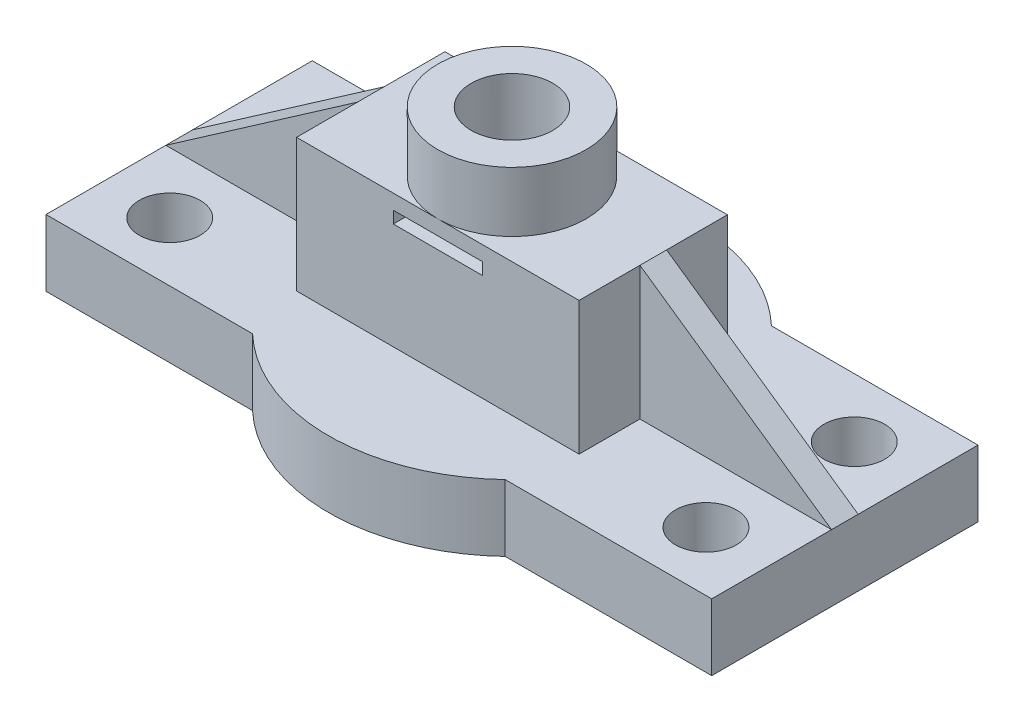
ISO-10303-21;
HEADER;
FILE_DESCRIPTION(('STEP AP214'),'2;1');
FILE_NAME('part.step','',(''),(''),'','','');
FILE_SCHEMA(('AUTOMOTIVE_DESIGN { 1 0 10303 214 1 1 1 1 }'));
ENDSEC;
DATA;
#1=APPLICATION_CONTEXT('core data for automotive mechanical design processes');
#2=APPLICATION_PROTOCOL_DEFINITION('international standard','automotive_design',2000,#1);
#3=PRODUCT_CONTEXT('',#1,'mechanical');
#4=PRODUCT('Part','Part','',(#3));
#5=PRODUCT_RELATED_PRODUCT_CATEGORY('part','',(#4));
#6=PRODUCT_DEFINITION_FORMATION('','',#4);
#7=PRODUCT_DEFINITION_CONTEXT('part definition',#1,'design');
#8=PRODUCT_DEFINITION('design','',#6,#7);
#9=PRODUCT_DEFINITION_SHAPE('','',#8);
#10=(LENGTH_UNIT() NAMED_UNIT(*) SI_UNIT(.MILLI.,.METRE.));
#11=(NAMED_UNIT(*) PLANE_ANGLE_UNIT() SI_UNIT($,.RADIAN.));
#12=(NAMED_UNIT(*) SI_UNIT($,.STERADIAN.) SOLID_ANGLE_UNIT());
#13=UNCERTAINTY_MEASURE_WITH_UNIT(LENGTH_MEASURE(1.E-05),#10,'distance_accuracy_value','');
#14=(GEOMETRIC_REPRESENTATION_CONTEXT(3) GLOBAL_UNCERTAINTY_ASSIGNED_CONTEXT((#13)) GLOBAL_UNIT_ASSIGNED_CONTEXT((#10,
#11,#12)) REPRESENTATION_CONTEXT('',''));
#15=CARTESIAN_POINT('',(0.,0.,0.));
#16=DIRECTION('',(0.,0.,1.));
#17=DIRECTION('',(1.,0.,0.));
#18=AXIS2_PLACEMENT_3D('',#15,#16,#17);
#19=CARTESIAN_POINT('',(0.,30.,0.));
#20=DIRECTION('',(0.,1.,0.));
#21=DIRECTION('',(0.,0.,1.));
#22=AXIS2_PLACEMENT_3D('',#19,#20,#21);
#23=PLANE('',#22);
#24=CARTESIAN_POINT('',(0.,30.,0.));
#25=DIRECTION('',(0.,1.,0.));
#26=DIRECTION('',(0.,0.,1.));
#27=AXIS2_PLACEMENT_3D('',#24,#25,#26);
#28=CIRCLE('',#27,11.1391021800904);
#29=CARTESIAN_POINT('',(0.,30.,11.1391021800904));
#30=VERTEX_POINT('',#29);
#31=CARTESIAN_POINT('',(0.,30.,-11.1391021800904));
#32=VERTEX_POINT('',#31);
#33=EDGE_CURVE('E258',#30,#32,#28,.T.);
#34=ORIENTED_EDGE('',*,*,#33,.F.);
#35=DIRECTION('',(1.,0.,0.));
#36=VECTOR('',#35,1.);
#37=CARTESIAN_POINT('',(-21.2181319609984,30.,11.1391021800904));
#38=LINE('',#37,#36);
#39=CARTESIAN_POINT('',(21.2181319609984,30.,11.1391021800904));
#40=VERTEX_POINT('',#39);
#41=EDGE_CURVE('E316',#30,#40,#38,.T.);
#42=ORIENTED_EDGE('',*,*,#41,.T.);
#43=DIRECTION('',(0.,0.,-1.));
#44=VECTOR('',#43,1.);
#45=CARTESIAN_POINT('',(21.2181319609984,30.,-11.1391021800904));
#46=LINE('',#45,#44);
#47=CARTESIAN_POINT('',(21.2181319609984,30.,2.));
#48=VERTEX_POINT('',#47);
#49=EDGE_CURVE('E304',#40,#48,#46,.T.);
#50=ORIENTED_EDGE('',*,*,#49,.T.);
#51=DIRECTION('',(0.,0.,-1.));
#52=VECTOR('',#51,1.);
#53=CARTESIAN_POINT('',(21.2181319609984,30.,2.));
#54=LINE('',#53,#52);
#55=CARTESIAN_POINT('',(21.2181319609984,30.,-2.));
#56=VERTEX_POINT('',#55);
#57=EDGE_CURVE('E273',#48,#56,#54,.T.);
#58=ORIENTED_EDGE('',*,*,#57,.T.);
#59=CARTESIAN_POINT('',(21.2181319609984,30.,-11.1391021800904));
#60=VERTEX_POINT('',#59);
#61=EDGE_CURVE('E308',#56,#60,#46,.T.);
#62=ORIENTED_EDGE('',*,*,#61,.T.);
#63=DIRECTION('',(-1.,0.,0.));
#64=VECTOR('',#63,1.);
#65=CARTESIAN_POINT('',(-21.2181319609984,30.,-11.1391021800904));
#66=LINE('',#65,#64);
#67=EDGE_CURVE('E309',#60,#32,#66,.T.);
#68=ORIENTED_EDGE('',*,*,#67,.T.);
#69=EDGE_LOOP('',(#34,#42,#50,#58,#62,#68));
#70=FACE_BOUND('',#69,.T.);
#71=ADVANCED_FACE('F43',(#70),#23,.T.);
#72=CARTESIAN_POINT('',(0.,10.,0.));
#73=DIRECTION('',(0.,1.,0.));
#74=DIRECTION('',(0.,0.,1.));
#75=AXIS2_PLACEMENT_3D('',#72,#73,#74);
#76=PLANE('',#75);
#77=CARTESIAN_POINT('',(-40.2746008637024,10.,-11.1391021800904));
#78=DIRECTION('',(0.,1.,0.));
#79=DIRECTION('',(0.,0.,1.));
#80=AXIS2_PLACEMENT_3D('',#77,#78,#79);
#81=CIRCLE('',#80,4.56693354904414);
#82=CARTESIAN_POINT('',(-40.2746008637024,10.,-6.57216863104625));
#83=VERTEX_POINT('',#82);
#84=EDGE_CURVE('E362',#83,#83,#81,.T.);
#85=ORIENTED_EDGE('',*,*,#84,.F.);
#86=EDGE_LOOP('',(#85));
#87=FACE_BOUND('',#86,.T.);
#88=CARTESIAN_POINT('',(40.2746008637024,10.,-11.1391021800904));
#89=DIRECTION('',(0.,1.,0.));
#90=DIRECTION('',(0.,0.,-1.));
#91=AXIS2_PLACEMENT_3D('',#88,#89,#90);
#92=CIRCLE('',#91,4.56693354904414);
#93=CARTESIAN_POINT('',(40.2746008637024,10.,-15.7060357291345));
#94=VERTEX_POINT('',#93);
#95=EDGE_CURVE('E344',#94,#94,#92,.T.);
#96=ORIENTED_EDGE('',*,*,#95,.F.);
#97=EDGE_LOOP('',(#96));
#98=FACE_BOUND('',#97,.T.);
#99=DIRECTION('',(0.,0.,-1.));
#100=VECTOR('',#99,1.);
#101=CARTESIAN_POINT('',(21.2181319609984,10.,-11.1391021800904));
#102=LINE('',#101,#100);
#103=CARTESIAN_POINT('',(21.2181319609984,10.,-2.));
#104=VERTEX_POINT('',#103);
#105=CARTESIAN_POINT('',(21.2181319609984,10.,-11.1391021800904));
#106=VERTEX_POINT('',#105);
#107=EDGE_CURVE('E303',#104,#106,#102,.T.);
#108=ORIENTED_EDGE('',*,*,#107,.F.);
#109=DIRECTION('',(1.,0.,0.));
#110=VECTOR('',#109,1.);
#111=CARTESIAN_POINT('',(50.,10.,-2.));
#112=LINE('',#111,#110);
#113=CARTESIAN_POINT('',(50.,10.,-2.));
#114=VERTEX_POINT('',#113);
#115=EDGE_CURVE('E276',#104,#114,#112,.T.);
#116=ORIENTED_EDGE('',*,*,#115,.T.);
#117=DIRECTION('',(0.,0.,-1.));
#118=VECTOR('',#117,1.);
#119=CARTESIAN_POINT('',(50.,10.,-20.));
#120=LINE('',#119,#118);
#121=CARTESIAN_POINT('',(50.,10.,-20.));
#122=VERTEX_POINT('',#121);
#123=EDGE_CURVE('E371',#114,#122,#120,.T.);
#124=ORIENTED_EDGE('',*,*,#123,.T.);
#125=DIRECTION('',(-1.,0.,0.));
#126=VECTOR('',#125,1.);
#127=CARTESIAN_POINT('',(18.9742408174705,10.,-20.));
#128=LINE('',#127,#126);
#129=CARTESIAN_POINT('',(18.9742408174705,10.,-20.));
#130=VERTEX_POINT('',#129);
#131=EDGE_CURVE('E376',#122,#130,#128,.T.);
#132=ORIENTED_EDGE('',*,*,#131,.T.);
#133=CARTESIAN_POINT('',(0.,10.,0.));
#134=DIRECTION('',(0.,1.,0.));
#135=DIRECTION('',(0.,0.,1.));
#136=AXIS2_PLACEMENT_3D('',#133,#134,#135);
#137=CIRCLE('',#136,27.568493150685);
#138=CARTESIAN_POINT('',(-18.9742408174705,10.,-20.));
#139=VERTEX_POINT('',#138);
#140=EDGE_CURVE('E378',#130,#139,#137,.T.);
#141=ORIENTED_EDGE('',*,*,#140,.T.);
#142=DIRECTION('',(-1.,0.,0.));
#143=VECTOR('',#142,1.);
#144=CARTESIAN_POINT('',(-50.,10.,-20.));
#145=LINE('',#144,#143);
#146=CARTESIAN_POINT('',(-50.,10.,-20.));
#147=VERTEX_POINT('',#146);
#148=EDGE_CURVE('E380',#139,#147,#145,.T.);
#149=ORIENTED_EDGE('',*,*,#148,.T.);
#150=DIRECTION('',(0.,0.,1.));
#151=VECTOR('',#150,1.);
#152=CARTESIAN_POINT('',(-50.,10.,-20.));
#153=LINE('',#152,#151);
#154=CARTESIAN_POINT('',(-50.,10.,-2.));
#155=VERTEX_POINT('',#154);
#156=EDGE_CURVE('E383',#147,#155,#153,.T.);
#157=ORIENTED_EDGE('',*,*,#156,.T.);
#158=DIRECTION('',(1.,0.,0.));
#159=VECTOR('',#158,1.);
#160=CARTESIAN_POINT('',(0.,10.,-2.));
#161=LINE('',#160,#159);
#162=CARTESIAN_POINT('',(-21.2181319609984,10.,-2.));
#163=VERTEX_POINT('',#162);
#164=EDGE_CURVE('E293',#155,#163,#161,.T.);
#165=ORIENTED_EDGE('',*,*,#164,.T.);
#166=DIRECTION('',(0.,0.,1.));
#167=VECTOR('',#166,1.);
#168=CARTESIAN_POINT('',(-21.2181319609984,10.,-11.1391021800904));
#169=LINE('',#168,#167);
#170=CARTESIAN_POINT('',(-21.2181319609984,10.,-11.1391021800904));
#171=VERTEX_POINT('',#170);
#172=EDGE_CURVE('E327',#171,#163,#169,.T.);
#173=ORIENTED_EDGE('',*,*,#172,.F.);
#174=DIRECTION('',(-1.,0.,0.));
#175=VECTOR('',#174,1.);
#176=CARTESIAN_POINT('',(-21.2181319609984,10.,-11.1391021800904));
#177=LINE('',#176,#175);
#178=EDGE_CURVE('E324',#106,#171,#177,.T.);
#179=ORIENTED_EDGE('',*,*,#178,.F.);
#180=EDGE_LOOP('',(#108,#116,#124,#132,#141,#149,#157,#165,#173,#179));
#181=FACE_BOUND('',#180,.T.);
#182=ADVANCED_FACE('F484',(#87,#98,#181),#76,.T.);
#183=CARTESIAN_POINT('',(21.2181319609984,30.,-11.1391021800904));
#184=DIRECTION('',(-1.,0.,0.));
#185=DIRECTION('',(0.,0.,1.));
#186=AXIS2_PLACEMENT_3D('',#183,#184,#185);
#187=PLANE('',#186);
#188=DIRECTION('',(0.,-1.,0.));
#189=VECTOR('',#188,1.);
#190=CARTESIAN_POINT('',(21.2181319609984,10.,-2.));
#191=LINE('',#190,#189);
#192=EDGE_CURVE('E262',#56,#104,#191,.T.);
#193=ORIENTED_EDGE('',*,*,#192,.T.);
#194=ORIENTED_EDGE('',*,*,#107,.T.);
#195=DIRECTION('',(0.,-1.,0.));
#196=VECTOR('',#195,1.);
#197=CARTESIAN_POINT('',(21.2181319609984,30.,-11.1391021800904));
#198=LINE('',#197,#196);
#199=EDGE_CURVE('E340',#60,#106,#198,.T.);
#200=ORIENTED_EDGE('',*,*,#199,.F.);
#201=ORIENTED_EDGE('',*,*,#61,.F.);
#202=EDGE_LOOP('',(#193,#194,#200,#201));
#203=FACE_BOUND('',#202,.T.);
#204=ADVANCED_FACE('F491',(#203),#187,.F.);
#205=CARTESIAN_POINT('',(-21.2181319609984,30.,-11.1391021800904));
#206=DIRECTION('',(1.,0.,0.));
#207=DIRECTION('',(0.,0.,-1.));
#208=AXIS2_PLACEMENT_3D('',#205,#206,#207);
#209=PLANE('',#208);
#210=DIRECTION('',(0.,-1.,0.));
#211=VECTOR('',#210,1.);
#212=CARTESIAN_POINT('',(-21.2181319609984,30.,-2.));
#213=LINE('',#212,#211);
#214=CARTESIAN_POINT('',(-21.2181319609984,30.,-2.));
#215=VERTEX_POINT('',#214);
#216=EDGE_CURVE('E289',#215,#163,#213,.T.);
#217=ORIENTED_EDGE('',*,*,#216,.F.);
#218=DIRECTION('',(0.,0.,1.));
#219=VECTOR('',#218,1.);
#220=CARTESIAN_POINT('',(-21.2181319609984,30.,-11.1391021800904));
#221=LINE('',#220,#219);
#222=CARTESIAN_POINT('',(-21.2181319609984,30.,-11.1391021800904));
#223=VERTEX_POINT('',#222);
#224=EDGE_CURVE('E313',#223,#215,#221,.T.);
#225=ORIENTED_EDGE('',*,*,#224,.F.);
#226=DIRECTION('',(0.,-1.,0.));
#227=VECTOR('',#226,1.);
#228=CARTESIAN_POINT('',(-21.2181319609984,30.,-11.1391021800904));
#229=LINE('',#228,#227);
#230=EDGE_CURVE('E337',#223,#171,#229,.T.);
#231=ORIENTED_EDGE('',*,*,#230,.T.);
#232=ORIENTED_EDGE('',*,*,#172,.T.);
#233=EDGE_LOOP('',(#217,#225,#231,#232));
#234=FACE_BOUND('',#233,.T.);
#235=ADVANCED_FACE('F547',(#234),#209,.F.);
#236=DIRECTION('',(1.,0.,0.));
#237=VECTOR('',#236,1.);
#238=CARTESIAN_POINT('',(50.,10.,2.));
#239=LINE('',#238,#237);
#240=CARTESIAN_POINT('',(21.2181319609984,10.,2.));
#241=VERTEX_POINT('',#240);
#242=CARTESIAN_POINT('',(50.,10.,2.));
#243=VERTEX_POINT('',#242);
#244=EDGE_CURVE('E268',#241,#243,#239,.T.);
#245=ORIENTED_EDGE('',*,*,#244,.F.);
#246=CARTESIAN_POINT('',(21.2181319609984,10.,11.1391021800904));
#247=VERTEX_POINT('',#246);
#248=EDGE_CURVE('E321',#247,#241,#102,.T.);
#249=ORIENTED_EDGE('',*,*,#248,.F.);
#250=DIRECTION('',(1.,0.,0.));
#251=VECTOR('',#250,1.);
#252=CARTESIAN_POINT('',(-21.2181319609984,10.,11.1391021800904));
#253=LINE('',#252,#251);
#254=CARTESIAN_POINT('',(-21.2181319609984,10.,11.1391021800904));
#255=VERTEX_POINT('',#254);
#256=EDGE_CURVE('E330',#255,#247,#253,.T.);
#257=ORIENTED_EDGE('',*,*,#256,.F.);
#258=CARTESIAN_POINT('',(-21.2181319609984,10.,2.));
#259=VERTEX_POINT('',#258);
#260=EDGE_CURVE('E326',#259,#255,#169,.T.);
#261=ORIENTED_EDGE('',*,*,#260,.F.);
#262=DIRECTION('',(1.,0.,0.));
#263=VECTOR('',#262,1.);
#264=CARTESIAN_POINT('',(0.,10.,2.));
#265=LINE('',#264,#263);
#266=CARTESIAN_POINT('',(-50.,10.,2.));
#267=VERTEX_POINT('',#266);
#268=EDGE_CURVE('E299',#267,#259,#265,.T.);
#269=ORIENTED_EDGE('',*,*,#268,.F.);
#270=CARTESIAN_POINT('',(-50.,10.,20.));
#271=VERTEX_POINT('',#270);
#272=EDGE_CURVE('E382',#267,#271,#153,.T.);
#273=ORIENTED_EDGE('',*,*,#272,.T.);
#274=DIRECTION('',(1.,0.,0.));
#275=VECTOR('',#274,1.);
#276=CARTESIAN_POINT('',(-50.,10.,20.));
#277=LINE('',#276,#275);
#278=CARTESIAN_POINT('',(-18.9742408174705,10.,20.));
#279=VERTEX_POINT('',#278);
#280=EDGE_CURVE('E386',#271,#279,#277,.T.);
#281=ORIENTED_EDGE('',*,*,#280,.T.);
#282=CARTESIAN_POINT('',(0.,10.,0.));
#283=DIRECTION('',(0.,1.,0.));
#284=DIRECTION('',(0.,0.,1.));
#285=AXIS2_PLACEMENT_3D('',#282,#283,#284);
#286=CIRCLE('',#285,27.568493150685);
#287=CARTESIAN_POINT('',(18.9742408174705,10.,20.));
#288=VERTEX_POINT('',#287);
#289=EDGE_CURVE('E388',#279,#288,#286,.T.);
#290=ORIENTED_EDGE('',*,*,#289,.T.);
#291=DIRECTION('',(1.,0.,0.));
#292=VECTOR('',#291,1.);
#293=CARTESIAN_POINT('',(18.9742408174705,10.,20.));
#294=LINE('',#293,#292);
#295=CARTESIAN_POINT('',(50.,10.,20.));
#296=VERTEX_POINT('',#295);
#297=EDGE_CURVE('E368',#288,#296,#294,.T.);
#298=ORIENTED_EDGE('',*,*,#297,.T.);
#299=EDGE_CURVE('E373',#296,#243,#120,.T.);
#300=ORIENTED_EDGE('',*,*,#299,.T.);
#301=EDGE_LOOP('',(#245,#249,#257,#261,#269,#273,#281,#290,#298,#300));
#302=FACE_BOUND('',#301,.T.);
#303=CARTESIAN_POINT('',(40.2746008637024,10.,11.1391021800904));
#304=DIRECTION('',(0.,1.,0.));
#305=DIRECTION('',(0.,0.,1.));
#306=AXIS2_PLACEMENT_3D('',#303,#304,#305);
#307=CIRCLE('',#306,4.56693354904414);
#308=CARTESIAN_POINT('',(40.2746008637024,10.,15.7060357291345));
#309=VERTEX_POINT('',#308);
#310=EDGE_CURVE('E350',#309,#309,#307,.T.);
#311=ORIENTED_EDGE('',*,*,#310,.F.);
#312=EDGE_LOOP('',(#311));
#313=FACE_BOUND('',#312,.T.);
#314=CARTESIAN_POINT('',(-40.2746008637024,10.,11.1391021800904));
#315=DIRECTION('',(0.,1.,0.));
#316=DIRECTION('',(0.,0.,-1.));
#317=AXIS2_PLACEMENT_3D('',#314,#315,#316);
#318=CIRCLE('',#317,4.56693354904414);
#319=CARTESIAN_POINT('',(-40.2746008637024,10.,6.57216863104625));
#320=VERTEX_POINT('',#319);
#321=EDGE_CURVE('E356',#320,#320,#318,.T.);
#322=ORIENTED_EDGE('',*,*,#321,.F.);
#323=EDGE_LOOP('',(#322));
#324=FACE_BOUND('',#323,.T.);
#325=ADVANCED_FACE('F467',(#302,#313,#324),#76,.T.);
#326=CARTESIAN_POINT('',(0.,0.,0.));
#327=DIRECTION('',(0.,1.,0.));
#328=DIRECTION('',(0.,0.,1.));
#329=AXIS2_PLACEMENT_3D('',#326,#327,#328);
#330=PLANE('',#329);
#331=CARTESIAN_POINT('',(0.,0.,0.));
#332=DIRECTION('',(0.,-1.,0.));
#333=DIRECTION('',(0.,0.,-1.));
#334=AXIS2_PLACEMENT_3D('',#331,#332,#333);
#335=CIRCLE('',#334,10.);
#336=CARTESIAN_POINT('',(0.,0.,-10.));
#337=VERTEX_POINT('',#336);
#338=EDGE_CURVE('E248',#337,#337,#335,.T.);
#339=ORIENTED_EDGE('',*,*,#338,.F.);
#340=EDGE_LOOP('',(#339));
#341=FACE_BOUND('',#340,.T.);
#342=DIRECTION('',(1.,0.,0.));
#343=VECTOR('',#342,1.);
#344=CARTESIAN_POINT('',(-50.,0.,20.));
#345=LINE('',#344,#343);
#346=CARTESIAN_POINT('',(-50.,0.,20.));
#347=VERTEX_POINT('',#346);
#348=CARTESIAN_POINT('',(-18.9742408174705,0.,20.));
#349=VERTEX_POINT('',#348);
#350=EDGE_CURVE('E403',#347,#349,#345,.T.);
#351=ORIENTED_EDGE('',*,*,#350,.F.);
#352=DIRECTION('',(0.,0.,1.));
#353=VECTOR('',#352,1.);
#354=CARTESIAN_POINT('',(-50.,0.,-20.));
#355=LINE('',#354,#353);
#356=CARTESIAN_POINT('',(-50.,0.,-20.));
#357=VERTEX_POINT('',#356);
#358=EDGE_CURVE('E401',#357,#347,#355,.T.);
#359=ORIENTED_EDGE('',*,*,#358,.F.);
#360=DIRECTION('',(-1.,0.,0.));
#361=VECTOR('',#360,1.);
#362=CARTESIAN_POINT('',(-50.,0.,-20.));
#363=LINE('',#362,#361);
#364=CARTESIAN_POINT('',(-18.9742408174705,0.,-20.));
#365=VERTEX_POINT('',#364);
#366=EDGE_CURVE('E399',#365,#357,#363,.T.);
#367=ORIENTED_EDGE('',*,*,#366,.F.);
#368=CARTESIAN_POINT('',(0.,0.,0.));
#369=DIRECTION('',(0.,1.,0.));
#370=DIRECTION('',(0.,0.,1.));
#371=AXIS2_PLACEMENT_3D('',#368,#369,#370);
#372=CIRCLE('',#371,27.568493150685);
#373=CARTESIAN_POINT('',(18.9742408174705,0.,-20.));
#374=VERTEX_POINT('',#373);
#375=EDGE_CURVE('E397',#374,#365,#372,.T.);
#376=ORIENTED_EDGE('',*,*,#375,.F.);
#377=DIRECTION('',(-1.,0.,0.));
#378=VECTOR('',#377,1.);
#379=CARTESIAN_POINT('',(18.9742408174705,0.,-20.));
#380=LINE('',#379,#378);
#381=CARTESIAN_POINT('',(50.,0.,-20.));
#382=VERTEX_POINT('',#381);
#383=EDGE_CURVE('E395',#382,#374,#380,.T.);
#384=ORIENTED_EDGE('',*,*,#383,.F.);
#385=DIRECTION('',(0.,0.,-1.));
#386=VECTOR('',#385,1.);
#387=CARTESIAN_POINT('',(50.,0.,-20.));
#388=LINE('',#387,#386);
#389=CARTESIAN_POINT('',(50.,0.,20.));
#390=VERTEX_POINT('',#389);
#391=EDGE_CURVE('E393',#390,#382,#388,.T.);
#392=ORIENTED_EDGE('',*,*,#391,.F.);
#393=DIRECTION('',(1.,0.,0.));
#394=VECTOR('',#393,1.);
#395=CARTESIAN_POINT('',(18.9742408174705,0.,20.));
#396=LINE('',#395,#394);
#397=CARTESIAN_POINT('',(18.9742408174705,0.,20.));
#398=VERTEX_POINT('',#397);
#399=EDGE_CURVE('E365',#398,#390,#396,.T.);
#400=ORIENTED_EDGE('',*,*,#399,.F.);
#401=CARTESIAN_POINT('',(0.,0.,0.));
#402=DIRECTION('',(0.,1.,0.));
#403=DIRECTION('',(0.,0.,1.));
#404=AXIS2_PLACEMENT_3D('',#401,#402,#403);
#405=CIRCLE('',#404,27.568493150685);
#406=EDGE_CURVE('E372',#349,#398,#405,.T.);
#407=ORIENTED_EDGE('',*,*,#406,.F.);
#408=EDGE_LOOP('',(#351,#359,#367,#376,#384,#392,#400,#407));
#409=FACE_BOUND('',#408,.T.);
#410=CARTESIAN_POINT('',(-40.2746008637024,0.,11.1391021800904));
#411=DIRECTION('',(0.,1.,0.));
#412=DIRECTION('',(0.,0.,-1.));
#413=AXIS2_PLACEMENT_3D('',#410,#411,#412);
#414=CIRCLE('',#413,4.56693354904414);
#415=CARTESIAN_POINT('',(-40.2746008637024,0.,6.57216863104625));
#416=VERTEX_POINT('',#415);
#417=EDGE_CURVE('E353',#416,#416,#414,.T.);
#418=ORIENTED_EDGE('',*,*,#417,.T.);
#419=EDGE_LOOP('',(#418));
#420=FACE_BOUND('',#419,.T.);
#421=CARTESIAN_POINT('',(40.2746008637024,0.,11.1391021800904));
#422=DIRECTION('',(0.,1.,0.));
#423=DIRECTION('',(0.,0.,1.));
#424=AXIS2_PLACEMENT_3D('',#421,#422,#423);
#425=CIRCLE('',#424,4.56693354904414);
#426=CARTESIAN_POINT('',(40.2746008637024,0.,15.7060357291345));
#427=VERTEX_POINT('',#426);
#428=EDGE_CURVE('E347',#427,#427,#425,.T.);
#429=ORIENTED_EDGE('',*,*,#428,.T.);
#430=EDGE_LOOP('',(#429));
#431=FACE_BOUND('',#430,.T.);
#432=CARTESIAN_POINT('',(40.2746008637024,0.,-11.1391021800904));
#433=DIRECTION('',(0.,1.,0.));
#434=DIRECTION('',(0.,0.,-1.));
#435=AXIS2_PLACEMENT_3D('',#432,#433,#434);
#436=CIRCLE('',#435,4.56693354904414);
#437=CARTESIAN_POINT('',(40.2746008637024,0.,-15.7060357291345));
#438=VERTEX_POINT('',#437);
#439=EDGE_CURVE('E343',#438,#438,#436,.T.);
#440=ORIENTED_EDGE('',*,*,#439,.T.);
#441=EDGE_LOOP('',(#440));
#442=FACE_BOUND('',#441,.T.);
#443=CARTESIAN_POINT('',(-40.2746008637024,0.,-11.1391021800904));
#444=DIRECTION('',(0.,1.,0.));
#445=DIRECTION('',(0.,0.,1.));
#446=AXIS2_PLACEMENT_3D('',#443,#444,#445);
#447=CIRCLE('',#446,4.56693354904414);
#448=CARTESIAN_POINT('',(-40.2746008637024,0.,-6.57216863104625));
#449=VERTEX_POINT('',#448);
#450=EDGE_CURVE('E359',#449,#449,#447,.T.);
#451=ORIENTED_EDGE('',*,*,#450,.T.);
#452=EDGE_LOOP('',(#451));
#453=FACE_BOUND('',#452,.T.);
#454=ADVANCED_FACE('F531',(#341,#409,#420,#431,#442,#453),#330,.F.);
#455=CARTESIAN_POINT('',(18.9742408174705,10.,20.));
#456=DIRECTION('',(0.,0.,-1.));
#457=DIRECTION('',(-1.,0.,0.));
#458=AXIS2_PLACEMENT_3D('',#455,#456,#457);
#459=PLANE('',#458);
#460=ORIENTED_EDGE('',*,*,#399,.T.);
#461=DIRECTION('',(0.,-1.,0.));
#462=VECTOR('',#461,1.);
#463=CARTESIAN_POINT('',(50.,10.,20.));
#464=LINE('',#463,#462);
#465=EDGE_CURVE('E426',#296,#390,#464,.T.);
#466=ORIENTED_EDGE('',*,*,#465,.F.);
#467=ORIENTED_EDGE('',*,*,#297,.F.);
#468=DIRECTION('',(0.,-1.,0.));
#469=VECTOR('',#468,1.);
#470=CARTESIAN_POINT('',(18.9742408174705,10.,20.));
#471=LINE('',#470,#469);
#472=EDGE_CURVE('E390',#288,#398,#471,.T.);
#473=ORIENTED_EDGE('',*,*,#472,.T.);
#474=EDGE_LOOP('',(#460,#466,#467,#473));
#475=FACE_BOUND('',#474,.T.);
#476=ADVANCED_FACE('F45',(#475),#459,.F.);
#477=CARTESIAN_POINT('',(50.,10.,-20.));
#478=DIRECTION('',(-1.,0.,0.));
#479=DIRECTION('',(0.,0.,1.));
#480=AXIS2_PLACEMENT_3D('',#477,#478,#479);
#481=PLANE('',#480);
#482=ORIENTED_EDGE('',*,*,#391,.T.);
#483=DIRECTION('',(0.,-1.,0.));
#484=VECTOR('',#483,1.);
#485=CARTESIAN_POINT('',(50.,10.,-20.));
#486=LINE('',#485,#484);
#487=EDGE_CURVE('E423',#122,#382,#486,.T.);
#488=ORIENTED_EDGE('',*,*,#487,.F.);
#489=ORIENTED_EDGE('',*,*,#123,.F.);
#490=DIRECTION('',(0.,0.,-1.));
#491=VECTOR('',#490,1.);
#492=CARTESIAN_POINT('',(50.,10.,2.));
#493=LINE('',#492,#491);
#494=EDGE_CURVE('E283',#243,#114,#493,.T.);
#495=ORIENTED_EDGE('',*,*,#494,.F.);
#496=ORIENTED_EDGE('',*,*,#299,.F.);
#497=ORIENTED_EDGE('',*,*,#465,.T.);
#498=EDGE_LOOP('',(#482,#488,#489,#495,#496,#497));
#499=FACE_BOUND('',#498,.T.);
#500=ADVANCED_FACE('F479',(#499),#481,.F.);
#501=CARTESIAN_POINT('',(18.9742408174705,10.,-20.));
#502=DIRECTION('',(0.,0.,1.));
#503=DIRECTION('',(1.,0.,0.));
#504=AXIS2_PLACEMENT_3D('',#501,#502,#503);
#505=PLANE('',#504);
#506=ORIENTED_EDGE('',*,*,#383,.T.);
#507=DIRECTION('',(0.,-1.,0.));
#508=VECTOR('',#507,1.);
#509=CARTESIAN_POINT('',(18.9742408174705,10.,-20.));
#510=LINE('',#509,#508);
#511=EDGE_CURVE('E420',#130,#374,#510,.T.);
#512=ORIENTED_EDGE('',*,*,#511,.F.);
#513=ORIENTED_EDGE('',*,*,#131,.F.);
#514=ORIENTED_EDGE('',*,*,#487,.T.);
#515=EDGE_LOOP('',(#506,#512,#513,#514));
#516=FACE_BOUND('',#515,.T.);
#517=ADVANCED_FACE('F529',(#516),#505,.F.);
#518=CARTESIAN_POINT('',(0.,10.,0.));
#519=DIRECTION('',(0.,-1.,0.));
#520=DIRECTION('',(0.,0.,-1.));
#521=AXIS2_PLACEMENT_3D('',#518,#519,#520);
#522=CYLINDRICAL_SURFACE('',#521,27.568493150685);
#523=ORIENTED_EDGE('',*,*,#375,.T.);
#524=DIRECTION('',(0.,-1.,0.));
#525=VECTOR('',#524,1.);
#526=CARTESIAN_POINT('',(-18.9742408174705,10.,-20.));
#527=LINE('',#526,#525);
#528=EDGE_CURVE('E417',#139,#365,#527,.T.);
#529=ORIENTED_EDGE('',*,*,#528,.F.);
#530=ORIENTED_EDGE('',*,*,#140,.F.);
#531=ORIENTED_EDGE('',*,*,#511,.T.);
#532=EDGE_LOOP('',(#523,#529,#530,#531));
#533=FACE_BOUND('',#532,.T.);
#534=ADVANCED_FACE('F536',(#533),#522,.T.);
#535=CARTESIAN_POINT('',(-50.,10.,-20.));
#536=DIRECTION('',(0.,0.,1.));
#537=DIRECTION('',(1.,0.,0.));
#538=AXIS2_PLACEMENT_3D('',#535,#536,#537);
#539=PLANE('',#538);
#540=ORIENTED_EDGE('',*,*,#366,.T.);
#541=DIRECTION('',(0.,-1.,0.));
#542=VECTOR('',#541,1.);
#543=CARTESIAN_POINT('',(-50.,10.,-20.));
#544=LINE('',#543,#542);
#545=EDGE_CURVE('E414',#147,#357,#544,.T.);
#546=ORIENTED_EDGE('',*,*,#545,.F.);
#547=ORIENTED_EDGE('',*,*,#148,.F.);
#548=ORIENTED_EDGE('',*,*,#528,.T.);
#549=EDGE_LOOP('',(#540,#546,#547,#548));
#550=FACE_BOUND('',#549,.T.);
#551=ADVANCED_FACE('F540',(#550),#539,.F.);
#552=CARTESIAN_POINT('',(-50.,10.,-20.));
#553=DIRECTION('',(1.,0.,0.));
#554=DIRECTION('',(0.,0.,-1.));
#555=AXIS2_PLACEMENT_3D('',#552,#553,#554);
#556=PLANE('',#555);
#557=ORIENTED_EDGE('',*,*,#272,.F.);
#558=DIRECTION('',(0.,0.,1.));
#559=VECTOR('',#558,1.);
#560=CARTESIAN_POINT('',(-50.,10.,-20.));
#561=LINE('',#560,#559);
#562=EDGE_CURVE('E301',#155,#267,#561,.T.);
#563=ORIENTED_EDGE('',*,*,#562,.F.);
#564=ORIENTED_EDGE('',*,*,#156,.F.);
#565=ORIENTED_EDGE('',*,*,#545,.T.);
#566=ORIENTED_EDGE('',*,*,#358,.T.);
#567=DIRECTION('',(0.,-1.,0.));
#568=VECTOR('',#567,1.);
#569=CARTESIAN_POINT('',(-50.,10.,20.));
#570=LINE('',#569,#568);
#571=EDGE_CURVE('E411',#271,#347,#570,.T.);
#572=ORIENTED_EDGE('',*,*,#571,.F.);
#573=EDGE_LOOP('',(#557,#563,#564,#565,#566,#572));
#574=FACE_BOUND('',#573,.T.);
#575=ADVANCED_FACE('F509',(#574),#556,.F.);
#576=CARTESIAN_POINT('',(-50.,10.,20.));
#577=DIRECTION('',(0.,0.,-1.));
#578=DIRECTION('',(-1.,0.,0.));
#579=AXIS2_PLACEMENT_3D('',#576,#577,#578);
#580=PLANE('',#579);
#581=ORIENTED_EDGE('',*,*,#350,.T.);
#582=DIRECTION('',(0.,-1.,0.));
#583=VECTOR('',#582,1.);
#584=CARTESIAN_POINT('',(-18.9742408174705,10.,20.));
#585=LINE('',#584,#583);
#586=EDGE_CURVE('E408',#279,#349,#585,.T.);
#587=ORIENTED_EDGE('',*,*,#586,.F.);
#588=ORIENTED_EDGE('',*,*,#280,.F.);
#589=ORIENTED_EDGE('',*,*,#571,.T.);
#590=EDGE_LOOP('',(#581,#587,#588,#589));
#591=FACE_BOUND('',#590,.T.);
#592=ADVANCED_FACE('F516',(#591),#580,.F.);
#593=CARTESIAN_POINT('',(0.,10.,0.));
#594=DIRECTION('',(0.,-1.,0.));
#595=DIRECTION('',(0.,0.,-1.));
#596=AXIS2_PLACEMENT_3D('',#593,#594,#595);
#597=CYLINDRICAL_SURFACE('',#596,27.568493150685);
#598=ORIENTED_EDGE('',*,*,#406,.T.);
#599=ORIENTED_EDGE('',*,*,#472,.F.);
#600=ORIENTED_EDGE('',*,*,#289,.F.);
#601=ORIENTED_EDGE('',*,*,#586,.T.);
#602=EDGE_LOOP('',(#598,#599,#600,#601));
#603=FACE_BOUND('',#602,.T.);
#604=ADVANCED_FACE('F522',(#603),#597,.T.);
#605=CARTESIAN_POINT('',(-40.2746008637024,10.,-11.1391021800904));
#606=DIRECTION('',(0.,-1.,0.));
#607=DIRECTION('',(0.,0.,-1.));
#608=AXIS2_PLACEMENT_3D('',#605,#606,#607);
#609=CYLINDRICAL_SURFACE('',#608,4.56693354904414);
#610=ORIENTED_EDGE('',*,*,#84,.T.);
#611=EDGE_LOOP('',(#610));
#612=FACE_BOUND('',#611,.T.);
#613=ORIENTED_EDGE('',*,*,#450,.F.);
#614=EDGE_LOOP('',(#613));
#615=FACE_BOUND('',#614,.T.);
#616=ADVANCED_FACE('F743',(#612,#615),#609,.F.);
#617=CARTESIAN_POINT('',(-40.2746008637024,10.,11.1391021800904));
#618=DIRECTION('',(0.,-1.,0.));
#619=DIRECTION('',(0.,0.,-1.));
#620=AXIS2_PLACEMENT_3D('',#617,#618,#619);
#621=CYLINDRICAL_SURFACE('',#620,4.56693354904414);
#622=ORIENTED_EDGE('',*,*,#321,.T.);
#623=EDGE_LOOP('',(#622));
#624=FACE_BOUND('',#623,.T.);
#625=ORIENTED_EDGE('',*,*,#417,.F.);
#626=EDGE_LOOP('',(#625));
#627=FACE_BOUND('',#626,.T.);
#628=ADVANCED_FACE('F735',(#624,#627),#621,.F.);
#629=CARTESIAN_POINT('',(40.2746008637024,10.,11.1391021800904));
#630=DIRECTION('',(0.,-1.,0.));
#631=DIRECTION('',(0.,0.,-1.));
#632=AXIS2_PLACEMENT_3D('',#629,#630,#631);
#633=CYLINDRICAL_SURFACE('',#632,4.56693354904414);
#634=ORIENTED_EDGE('',*,*,#310,.T.);
#635=EDGE_LOOP('',(#634));
#636=FACE_BOUND('',#635,.T.);
#637=ORIENTED_EDGE('',*,*,#428,.F.);
#638=EDGE_LOOP('',(#637));
#639=FACE_BOUND('',#638,.T.);
#640=ADVANCED_FACE('F726',(#636,#639),#633,.F.);
#641=CARTESIAN_POINT('',(40.2746008637024,10.,-11.1391021800904));
#642=DIRECTION('',(0.,-1.,0.));
#643=DIRECTION('',(0.,0.,-1.));
#644=AXIS2_PLACEMENT_3D('',#641,#642,#643);
#645=CYLINDRICAL_SURFACE('',#644,4.56693354904414);
#646=ORIENTED_EDGE('',*,*,#95,.T.);
#647=EDGE_LOOP('',(#646));
#648=FACE_BOUND('',#647,.T.);
#649=ORIENTED_EDGE('',*,*,#439,.F.);
#650=EDGE_LOOP('',(#649));
#651=FACE_BOUND('',#650,.T.);
#652=ADVANCED_FACE('F718',(#648,#651),#645,.F.);
#653=ORIENTED_EDGE('',*,*,#248,.T.);
#654=DIRECTION('',(0.,-1.,0.));
#655=VECTOR('',#654,1.);
#656=CARTESIAN_POINT('',(21.2181319609984,10.,2.));
#657=LINE('',#656,#655);
#658=EDGE_CURVE('E266',#48,#241,#657,.T.);
#659=ORIENTED_EDGE('',*,*,#658,.F.);
#660=ORIENTED_EDGE('',*,*,#49,.F.);
#661=DIRECTION('',(0.,-1.,0.));
#662=VECTOR('',#661,1.);
#663=CARTESIAN_POINT('',(21.2181319609984,30.,11.1391021800904));
#664=LINE('',#663,#662);
#665=EDGE_CURVE('E320',#40,#247,#664,.T.);
#666=ORIENTED_EDGE('',*,*,#665,.T.);
#667=EDGE_LOOP('',(#653,#659,#660,#666));
#668=FACE_BOUND('',#667,.T.);
#669=ADVANCED_FACE('F464',(#668),#187,.F.);
#670=CARTESIAN_POINT('',(-21.2181319609984,30.,-11.1391021800904));
#671=DIRECTION('',(0.,0.,1.));
#672=DIRECTION('',(1.,0.,0.));
#673=AXIS2_PLACEMENT_3D('',#670,#671,#672);
#674=PLANE('',#673);
#675=ORIENTED_EDGE('',*,*,#178,.T.);
#676=ORIENTED_EDGE('',*,*,#230,.F.);
#677=EDGE_CURVE('E307',#32,#223,#66,.T.);
#678=ORIENTED_EDGE('',*,*,#677,.F.);
#679=ORIENTED_EDGE('',*,*,#67,.F.);
#680=ORIENTED_EDGE('',*,*,#199,.T.);
#681=EDGE_LOOP('',(#675,#676,#678,#679,#680));
#682=FACE_BOUND('',#681,.T.);
#683=ADVANCED_FACE('F551',(#682),#674,.F.);
#684=CARTESIAN_POINT('',(-21.2181319609984,30.,2.));
#685=VERTEX_POINT('',#684);
#686=CARTESIAN_POINT('',(-21.2181319609984,30.,11.1391021800904));
#687=VERTEX_POINT('',#686);
#688=EDGE_CURVE('E312',#685,#687,#221,.T.);
#689=ORIENTED_EDGE('',*,*,#688,.F.);
#690=DIRECTION('',(0.,-1.,0.));
#691=VECTOR('',#690,1.);
#692=CARTESIAN_POINT('',(-21.2181319609984,30.,2.));
#693=LINE('',#692,#691);
#694=EDGE_CURVE('E296',#685,#259,#693,.T.);
#695=ORIENTED_EDGE('',*,*,#694,.T.);
#696=ORIENTED_EDGE('',*,*,#260,.T.);
#697=DIRECTION('',(0.,-1.,0.));
#698=VECTOR('',#697,1.);
#699=CARTESIAN_POINT('',(-21.2181319609984,30.,11.1391021800904));
#700=LINE('',#699,#698);
#701=EDGE_CURVE('E334',#687,#255,#700,.T.);
#702=ORIENTED_EDGE('',*,*,#701,.F.);
#703=EDGE_LOOP('',(#689,#695,#696,#702));
#704=FACE_BOUND('',#703,.T.);
#705=ADVANCED_FACE('F452',(#704),#209,.F.);
#706=CARTESIAN_POINT('',(-21.2181319609984,30.,11.1391021800904));
#707=DIRECTION('',(0.,0.,-1.));
#708=DIRECTION('',(-1.,0.,0.));
#709=AXIS2_PLACEMENT_3D('',#706,#707,#708);
#710=PLANE('',#709);
#711=DIRECTION('',(-1.,0.,0.));
#712=VECTOR('',#711,1.);
#713=CARTESIAN_POINT('',(-6.69024429392524,27.7815087236258,11.1391021800904));
#714=LINE('',#713,#712);
#715=CARTESIAN_POINT('',(6.69024429392524,27.7815087236258,11.1391021800904));
#716=VERTEX_POINT('',#715);
#717=CARTESIAN_POINT('',(-6.69024429392524,27.7815087236258,11.1391021800904));
#718=VERTEX_POINT('',#717);
#719=EDGE_CURVE('E242',#716,#718,#714,.T.);
#720=ORIENTED_EDGE('',*,*,#719,.F.);
#721=DIRECTION('',(0.,1.,0.));
#722=VECTOR('',#721,1.);
#723=CARTESIAN_POINT('',(6.69024429392524,27.7815087236258,11.1391021800904));
#724=LINE('',#723,#722);
#725=CARTESIAN_POINT('',(6.69024429392524,25.9815982911553,11.1391021800904));
#726=VERTEX_POINT('',#725);
#727=EDGE_CURVE('E58',#726,#716,#724,.T.);
#728=ORIENTED_EDGE('',*,*,#727,.F.);
#729=DIRECTION('',(1.,0.,0.));
#730=VECTOR('',#729,1.);
#731=CARTESIAN_POINT('',(6.69024429392524,25.9815982911553,11.1391021800904));
#732=LINE('',#731,#730);
#733=CARTESIAN_POINT('',(-6.69024429392524,25.9815982911553,11.1391021800904));
#734=VERTEX_POINT('',#733);
#735=EDGE_CURVE('E233',#734,#726,#732,.T.);
#736=ORIENTED_EDGE('',*,*,#735,.F.);
#737=DIRECTION('',(0.,-1.,0.));
#738=VECTOR('',#737,1.);
#739=CARTESIAN_POINT('',(-6.69024429392524,27.7815087236258,11.1391021800904));
#740=LINE('',#739,#738);
#741=EDGE_CURVE('E236',#718,#734,#740,.T.);
#742=ORIENTED_EDGE('',*,*,#741,.F.);
#743=EDGE_LOOP('',(#720,#728,#736,#742));
#744=FACE_BOUND('',#743,.T.);
#745=ORIENTED_EDGE('',*,*,#256,.T.);
#746=ORIENTED_EDGE('',*,*,#665,.F.);
#747=ORIENTED_EDGE('',*,*,#41,.F.);
#748=EDGE_CURVE('E318',#687,#30,#38,.T.);
#749=ORIENTED_EDGE('',*,*,#748,.F.);
#750=ORIENTED_EDGE('',*,*,#701,.T.);
#751=EDGE_LOOP('',(#745,#746,#747,#749,#750));
#752=FACE_BOUND('',#751,.T.);
#753=ADVANCED_FACE('F448',(#744,#752),#710,.F.);
#754=EDGE_CURVE('E265',#32,#30,#28,.T.);
#755=ORIENTED_EDGE('',*,*,#754,.F.);
#756=ORIENTED_EDGE('',*,*,#677,.T.);
#757=ORIENTED_EDGE('',*,*,#224,.T.);
#758=EDGE_CURVE('E317',#215,#685,#221,.T.);
#759=ORIENTED_EDGE('',*,*,#758,.T.);
#760=ORIENTED_EDGE('',*,*,#688,.T.);
#761=ORIENTED_EDGE('',*,*,#748,.T.);
#762=EDGE_LOOP('',(#755,#756,#757,#759,#760,#761));
#763=FACE_BOUND('',#762,.T.);
#764=ADVANCED_FACE('F451',(#763),#23,.T.);
#765=CARTESIAN_POINT('',(-21.2181319609984,30.,0.));
#766=DIRECTION('',(-0.570638161287801,0.821201612810202,0.));
#767=DIRECTION('',(-0.821201612810202,-0.570638161287801,0.));
#768=AXIS2_PLACEMENT_3D('',#765,#766,#767);
#769=PLANE('',#768);
#770=DIRECTION('',(-0.821201612810202,-0.570638161287801,0.));
#771=VECTOR('',#770,1.);
#772=CARTESIAN_POINT('',(-21.2181319609984,30.,-2.));
#773=LINE('',#772,#771);
#774=EDGE_CURVE('E285',#215,#155,#773,.T.);
#775=ORIENTED_EDGE('',*,*,#774,.T.);
#776=ORIENTED_EDGE('',*,*,#562,.T.);
#777=DIRECTION('',(-0.821201612810202,-0.570638161287801,0.));
#778=VECTOR('',#777,1.);
#779=CARTESIAN_POINT('',(-21.2181319609984,30.,2.));
#780=LINE('',#779,#778);
#781=EDGE_CURVE('E286',#685,#267,#780,.T.);
#782=ORIENTED_EDGE('',*,*,#781,.F.);
#783=ORIENTED_EDGE('',*,*,#758,.F.);
#784=EDGE_LOOP('',(#775,#776,#782,#783));
#785=FACE_BOUND('',#784,.T.);
#786=ADVANCED_FACE('F577',(#785),#769,.T.);
#787=CARTESIAN_POINT('',(0.,15.,2.));
#788=DIRECTION('',(0.,0.,1.));
#789=DIRECTION('',(1.,0.,0.));
#790=AXIS2_PLACEMENT_3D('',#787,#788,#789);
#791=PLANE('',#790);
#792=ORIENTED_EDGE('',*,*,#781,.T.);
#793=ORIENTED_EDGE('',*,*,#268,.T.);
#794=ORIENTED_EDGE('',*,*,#694,.F.);
#795=EDGE_LOOP('',(#792,#793,#794));
#796=FACE_BOUND('',#795,.T.);
#797=ADVANCED_FACE('F581',(#796),#791,.T.);
#798=CARTESIAN_POINT('',(0.,15.,-2.));
#799=DIRECTION('',(0.,0.,1.));
#800=DIRECTION('',(1.,0.,0.));
#801=AXIS2_PLACEMENT_3D('',#798,#799,#800);
#802=PLANE('',#801);
#803=ORIENTED_EDGE('',*,*,#164,.F.);
#804=ORIENTED_EDGE('',*,*,#774,.F.);
#805=ORIENTED_EDGE('',*,*,#216,.T.);
#806=EDGE_LOOP('',(#803,#804,#805));
#807=FACE_BOUND('',#806,.T.);
#808=ADVANCED_FACE('F586',(#807),#802,.F.);
#809=CARTESIAN_POINT('',(21.2181319609984,30.,2.));
#810=DIRECTION('',(-0.570638161287801,-0.821201612810202,0.));
#811=DIRECTION('',(0.821201612810202,-0.570638161287801,0.));
#812=AXIS2_PLACEMENT_3D('',#809,#810,#811);
#813=PLANE('',#812);
#814=DIRECTION('',(-0.821201612810202,0.570638161287801,0.));
#815=VECTOR('',#814,1.);
#816=CARTESIAN_POINT('',(21.2181319609984,30.,-2.));
#817=LINE('',#816,#815);
#818=EDGE_CURVE('E269',#114,#56,#817,.T.);
#819=ORIENTED_EDGE('',*,*,#818,.T.);
#820=ORIENTED_EDGE('',*,*,#57,.F.);
#821=DIRECTION('',(-0.821201612810202,0.570638161287801,0.));
#822=VECTOR('',#821,1.);
#823=CARTESIAN_POINT('',(21.2181319609984,30.,2.));
#824=LINE('',#823,#822);
#825=EDGE_CURVE('E271',#243,#48,#824,.T.);
#826=ORIENTED_EDGE('',*,*,#825,.F.);
#827=ORIENTED_EDGE('',*,*,#494,.T.);
#828=EDGE_LOOP('',(#819,#820,#826,#827));
#829=FACE_BOUND('',#828,.T.);
#830=ADVANCED_FACE('F475',(#829),#813,.F.);
#831=CARTESIAN_POINT('',(0.,0.,2.));
#832=DIRECTION('',(0.,0.,1.));
#833=DIRECTION('',(1.,0.,0.));
#834=AXIS2_PLACEMENT_3D('',#831,#832,#833);
#835=PLANE('',#834);
#836=ORIENTED_EDGE('',*,*,#658,.T.);
#837=ORIENTED_EDGE('',*,*,#244,.T.);
#838=ORIENTED_EDGE('',*,*,#825,.T.);
#839=EDGE_LOOP('',(#836,#837,#838));
#840=FACE_BOUND('',#839,.T.);
#841=ADVANCED_FACE('F471',(#840),#835,.T.);
#842=CARTESIAN_POINT('',(0.,0.,-2.));
#843=DIRECTION('',(0.,0.,1.));
#844=DIRECTION('',(1.,0.,0.));
#845=AXIS2_PLACEMENT_3D('',#842,#843,#844);
#846=PLANE('',#845);
#847=ORIENTED_EDGE('',*,*,#192,.F.);
#848=ORIENTED_EDGE('',*,*,#818,.F.);
#849=ORIENTED_EDGE('',*,*,#115,.F.);
#850=EDGE_LOOP('',(#847,#848,#849));
#851=FACE_BOUND('',#850,.T.);
#852=ADVANCED_FACE('F488',(#851),#846,.F.);
#853=CARTESIAN_POINT('',(0.,39.,0.));
#854=DIRECTION('',(0.,1.,0.));
#855=DIRECTION('',(0.,0.,1.));
#856=AXIS2_PLACEMENT_3D('',#853,#854,#855);
#857=PLANE('',#856);
#858=CARTESIAN_POINT('',(0.,39.,0.));
#859=DIRECTION('',(0.,1.,0.));
#860=DIRECTION('',(0.,0.,1.));
#861=AXIS2_PLACEMENT_3D('',#858,#859,#860);
#862=CIRCLE('',#861,11.1391021800904);
#863=CARTESIAN_POINT('',(0.,39.,11.1391021800904));
#864=VERTEX_POINT('',#863);
#865=EDGE_CURVE('E259',#864,#864,#862,.T.);
#866=ORIENTED_EDGE('',*,*,#865,.T.);
#867=EDGE_LOOP('',(#866));
#868=FACE_BOUND('',#867,.T.);
#869=CARTESIAN_POINT('',(0.,39.,0.));
#870=DIRECTION('',(0.,1.,0.));
#871=DIRECTION('',(1.,0.,0.));
#872=AXIS2_PLACEMENT_3D('',#869,#870,#871);
#873=CIRCLE('',#872,6.13910218009039);
#874=CARTESIAN_POINT('',(6.13910218009039,39.,0.));
#875=VERTEX_POINT('',#874);
#876=EDGE_CURVE('E255',#875,#875,#873,.T.);
#877=ORIENTED_EDGE('',*,*,#876,.F.);
#878=EDGE_LOOP('',(#877));
#879=FACE_BOUND('',#878,.T.);
#880=ADVANCED_FACE('F555',(#868,#879),#857,.T.);
#881=CARTESIAN_POINT('',(0.,39.,0.));
#882=DIRECTION('',(0.,-1.,0.));
#883=DIRECTION('',(0.,0.,-1.));
#884=AXIS2_PLACEMENT_3D('',#881,#882,#883);
#885=CYLINDRICAL_SURFACE('',#884,11.1391021800904);
#886=ORIENTED_EDGE('',*,*,#865,.F.);
#887=EDGE_LOOP('',(#886));
#888=FACE_BOUND('',#887,.T.);
#889=ORIENTED_EDGE('',*,*,#33,.T.);
#890=ORIENTED_EDGE('',*,*,#754,.T.);
#891=EDGE_LOOP('',(#889,#890));
#892=FACE_BOUND('',#891,.T.);
#893=ADVANCED_FACE('F553',(#888,#892),#885,.T.);
#894=CARTESIAN_POINT('',(0.,39.,0.));
#895=DIRECTION('',(0.,-1.,0.));
#896=DIRECTION('',(0.,0.,-1.));
#897=AXIS2_PLACEMENT_3D('',#894,#895,#896);
#898=CYLINDRICAL_SURFACE('',#897,6.13910218009039);
#899=DIRECTION('',(0.,-1.,0.));
#900=VECTOR('',#899,1.);
#901=CARTESIAN_POINT('',(5.75437376616458,39.,2.13910218009039));
#902=LINE('',#901,#900);
#903=CARTESIAN_POINT('',(5.75437376616458,27.7815087236258,2.13910218009039));
#904=VERTEX_POINT('',#903);
#905=CARTESIAN_POINT('',(5.75437376616458,25.9815982911553,2.13910218009039));
#906=VERTEX_POINT('',#905);
#907=EDGE_CURVE('E12',#904,#906,#902,.T.);
#908=ORIENTED_EDGE('',*,*,#907,.F.);
#909=CARTESIAN_POINT('',(0.,27.7815087236258,0.));
#910=DIRECTION('',(0.,1.,0.));
#911=DIRECTION('',(0.,0.,1.));
#912=AXIS2_PLACEMENT_3D('',#909,#910,#911);
#913=CIRCLE('',#912,6.13910218009039);
#914=CARTESIAN_POINT('',(-5.75437376616458,27.7815087236258,2.13910218009039));
#915=VERTEX_POINT('',#914);
#916=EDGE_CURVE('E223',#915,#904,#913,.T.);
#917=ORIENTED_EDGE('',*,*,#916,.F.);
#918=DIRECTION('',(0.,-1.,0.));
#919=VECTOR('',#918,1.);
#920=CARTESIAN_POINT('',(-5.75437376616458,39.,2.13910218009039));
#921=LINE('',#920,#919);
#922=CARTESIAN_POINT('',(-5.75437376616458,25.9815982911553,2.13910218009039));
#923=VERTEX_POINT('',#922);
#924=EDGE_CURVE('E431',#923,#915,#921,.F.);
#925=ORIENTED_EDGE('',*,*,#924,.F.);
#926=CARTESIAN_POINT('',(0.,25.9815982911553,0.));
#927=DIRECTION('',(0.,-1.,0.));
#928=DIRECTION('',(0.,0.,-1.));
#929=AXIS2_PLACEMENT_3D('',#926,#927,#928);
#930=CIRCLE('',#929,6.13910218009039);
#931=EDGE_CURVE('E51',#906,#923,#930,.T.);
#932=ORIENTED_EDGE('',*,*,#931,.F.);
#933=EDGE_LOOP('',(#908,#917,#925,#932));
#934=FACE_BOUND('',#933,.T.);
#935=CARTESIAN_POINT('',(0.,18.9769190657762,0.));
#936=DIRECTION('',(0.,-1.,0.));
#937=DIRECTION('',(0.,0.,-1.));
#938=AXIS2_PLACEMENT_3D('',#935,#936,#937);
#939=CIRCLE('',#938,6.13910218009039);
#940=CARTESIAN_POINT('',(0.,18.9769190657762,-6.13910218009039));
#941=VERTEX_POINT('',#940);
#942=EDGE_CURVE('E254',#941,#941,#939,.F.);
#943=ORIENTED_EDGE('',*,*,#942,.F.);
#944=EDGE_LOOP('',(#943));
#945=FACE_BOUND('',#944,.T.);
#946=ORIENTED_EDGE('',*,*,#876,.T.);
#947=EDGE_LOOP('',(#946));
#948=FACE_BOUND('',#947,.T.);
#949=ADVANCED_FACE('F438',(#934,#945,#948),#898,.F.);
#950=CARTESIAN_POINT('',(0.,0.,0.));
#951=DIRECTION('',(0.,-1.,0.));
#952=DIRECTION('',(0.,0.,-1.));
#953=AXIS2_PLACEMENT_3D('',#950,#951,#952);
#954=CONICAL_SURFACE('',#953,10.,0.200712863979348);
#955=ORIENTED_EDGE('',*,*,#942,.T.);
#956=EDGE_LOOP('',(#955));
#957=FACE_BOUND('',#956,.T.);
#958=ORIENTED_EDGE('',*,*,#338,.T.);
#959=EDGE_LOOP('',(#958));
#960=FACE_BOUND('',#959,.T.);
#961=ADVANCED_FACE('F562',(#957,#960),#954,.F.);
#962=CARTESIAN_POINT('',(0.,0.,2.13910218009039));
#963=DIRECTION('',(0.,0.,-1.));
#964=DIRECTION('',(-1.,0.,0.));
#965=AXIS2_PLACEMENT_3D('',#962,#963,#964);
#966=PLANE('',#965);
#967=ORIENTED_EDGE('',*,*,#907,.T.);
#968=DIRECTION('',(1.,0.,0.));
#969=VECTOR('',#968,1.);
#970=CARTESIAN_POINT('',(6.69024429392524,25.9815982911553,2.13910218009039));
#971=LINE('',#970,#969);
#972=CARTESIAN_POINT('',(6.69024429392524,25.9815982911553,2.13910218009039));
#973=VERTEX_POINT('',#972);
#974=EDGE_CURVE('E231',#906,#973,#971,.T.);
#975=ORIENTED_EDGE('',*,*,#974,.T.);
#976=DIRECTION('',(0.,1.,0.));
#977=VECTOR('',#976,1.);
#978=CARTESIAN_POINT('',(6.69024429392524,27.7815087236258,2.13910218009039));
#979=LINE('',#978,#977);
#980=CARTESIAN_POINT('',(6.69024429392524,27.7815087236258,2.13910218009039));
#981=VERTEX_POINT('',#980);
#982=EDGE_CURVE('E212',#973,#981,#979,.T.);
#983=ORIENTED_EDGE('',*,*,#982,.T.);
#984=DIRECTION('',(-1.,0.,0.));
#985=VECTOR('',#984,1.);
#986=CARTESIAN_POINT('',(-6.69024429392524,27.7815087236258,2.13910218009039));
#987=LINE('',#986,#985);
#988=EDGE_CURVE('E219',#981,#904,#987,.T.);
#989=ORIENTED_EDGE('',*,*,#988,.T.);
#990=EDGE_LOOP('',(#967,#975,#983,#989));
#991=FACE_BOUND('',#990,.T.);
#992=ADVANCED_FACE('F229',(#991),#966,.F.);
#993=CARTESIAN_POINT('',(6.69024429392524,27.7815087236258,2.13910218009039));
#994=DIRECTION('',(1.,0.,0.));
#995=DIRECTION('',(0.,0.,-1.));
#996=AXIS2_PLACEMENT_3D('',#993,#994,#995);
#997=PLANE('',#996);
#998=ORIENTED_EDGE('',*,*,#727,.T.);
#999=DIRECTION('',(0.,0.,1.));
#1000=VECTOR('',#999,1.);
#1001=CARTESIAN_POINT('',(6.69024429392524,27.7815087236258,2.13910218009039));
#1002=LINE('',#1001,#1000);
#1003=EDGE_CURVE('E208',#981,#716,#1002,.T.);
#1004=ORIENTED_EDGE('',*,*,#1003,.F.);
#1005=ORIENTED_EDGE('',*,*,#982,.F.);
#1006=DIRECTION('',(0.,0.,1.));
#1007=VECTOR('',#1006,1.);
#1008=CARTESIAN_POINT('',(6.69024429392524,25.9815982911553,2.13910218009039));
#1009=LINE('',#1008,#1007);
#1010=EDGE_CURVE('E246',#973,#726,#1009,.T.);
#1011=ORIENTED_EDGE('',*,*,#1010,.T.);
#1012=EDGE_LOOP('',(#998,#1004,#1005,#1011));
#1013=FACE_BOUND('',#1012,.T.);
#1014=ADVANCED_FACE('F210',(#1013),#997,.F.);
#1015=CARTESIAN_POINT('',(6.69024429392524,25.9815982911553,2.13910218009039));
#1016=DIRECTION('',(0.,-1.,0.));
#1017=DIRECTION('',(0.,0.,-1.));
#1018=AXIS2_PLACEMENT_3D('',#1015,#1016,#1017);
#1019=PLANE('',#1018);
#1020=ORIENTED_EDGE('',*,*,#931,.T.);
#1021=CARTESIAN_POINT('',(-6.69024429392524,25.9815982911553,2.13910218009039));
#1022=VERTEX_POINT('',#1021);
#1023=EDGE_CURVE('E66',#1022,#923,#971,.T.);
#1024=ORIENTED_EDGE('',*,*,#1023,.F.);
#1025=DIRECTION('',(0.,0.,1.));
#1026=VECTOR('',#1025,1.);
#1027=CARTESIAN_POINT('',(-6.69024429392524,25.9815982911553,2.13910218009039));
#1028=LINE('',#1027,#1026);
#1029=EDGE_CURVE('E249',#1022,#734,#1028,.T.);
#1030=ORIENTED_EDGE('',*,*,#1029,.T.);
#1031=ORIENTED_EDGE('',*,*,#735,.T.);
#1032=ORIENTED_EDGE('',*,*,#1010,.F.);
#1033=ORIENTED_EDGE('',*,*,#974,.F.);
#1034=EDGE_LOOP('',(#1020,#1024,#1030,#1031,#1032,#1033));
#1035=FACE_BOUND('',#1034,.T.);
#1036=ADVANCED_FACE('F436',(#1035),#1019,.F.);
#1037=CARTESIAN_POINT('',(-6.69024429392524,27.7815087236258,2.13910218009039));
#1038=DIRECTION('',(-1.,0.,0.));
#1039=DIRECTION('',(0.,0.,1.));
#1040=AXIS2_PLACEMENT_3D('',#1037,#1038,#1039);
#1041=PLANE('',#1040);
#1042=ORIENTED_EDGE('',*,*,#741,.T.);
#1043=ORIENTED_EDGE('',*,*,#1029,.F.);
#1044=DIRECTION('',(0.,-1.,0.));
#1045=VECTOR('',#1044,1.);
#1046=CARTESIAN_POINT('',(-6.69024429392524,27.7815087236258,2.13910218009039));
#1047=LINE('',#1046,#1045);
#1048=CARTESIAN_POINT('',(-6.69024429392524,27.7815087236258,2.13910218009039));
#1049=VERTEX_POINT('',#1048);
#1050=EDGE_CURVE('E226',#1049,#1022,#1047,.T.);
#1051=ORIENTED_EDGE('',*,*,#1050,.F.);
#1052=DIRECTION('',(0.,0.,1.));
#1053=VECTOR('',#1052,1.);
#1054=CARTESIAN_POINT('',(-6.69024429392524,27.7815087236258,2.13910218009039));
#1055=LINE('',#1054,#1053);
#1056=EDGE_CURVE('E216',#1049,#718,#1055,.T.);
#1057=ORIENTED_EDGE('',*,*,#1056,.T.);
#1058=EDGE_LOOP('',(#1042,#1043,#1051,#1057));
#1059=FACE_BOUND('',#1058,.T.);
#1060=ADVANCED_FACE('F445',(#1059),#1041,.F.);
#1061=CARTESIAN_POINT('',(-6.69024429392524,27.7815087236258,2.13910218009039));
#1062=DIRECTION('',(0.,1.,0.));
#1063=DIRECTION('',(0.,0.,1.));
#1064=AXIS2_PLACEMENT_3D('',#1061,#1062,#1063);
#1065=PLANE('',#1064);
#1066=ORIENTED_EDGE('',*,*,#916,.T.);
#1067=ORIENTED_EDGE('',*,*,#988,.F.);
#1068=ORIENTED_EDGE('',*,*,#1003,.T.);
#1069=ORIENTED_EDGE('',*,*,#719,.T.);
#1070=ORIENTED_EDGE('',*,*,#1056,.F.);
#1071=EDGE_CURVE('E227',#915,#1049,#987,.T.);
#1072=ORIENTED_EDGE('',*,*,#1071,.F.);
#1073=EDGE_LOOP('',(#1066,#1067,#1068,#1069,#1070,#1072));
#1074=FACE_BOUND('',#1073,.T.);
#1075=ADVANCED_FACE('F220',(#1074),#1065,.F.);
#1076=ORIENTED_EDGE('',*,*,#924,.T.);
#1077=ORIENTED_EDGE('',*,*,#1071,.T.);
#1078=ORIENTED_EDGE('',*,*,#1050,.T.);
#1079=ORIENTED_EDGE('',*,*,#1023,.T.);
#1080=EDGE_LOOP('',(#1076,#1077,#1078,#1079));
#1081=FACE_BOUND('',#1080,.T.);
#1082=ADVANCED_FACE('F440',(#1081),#966,.F.);
#1083=CLOSED_SHELL('',(#71,#182,#204,#235,#325,#454,#476,#500,#517,#534,#551,#575,#592,#604,
#616,#628,#640,#652,#669,#683,#705,#753,#764,#786,#797,#808,#830,#841,#852,#880,#893,#949,#961,
#992,#1014,#1036,#1060,#1075,#1082));
#1084=MANIFOLD_SOLID_BREP('B2',#1083);
#1085=ADVANCED_BREP_SHAPE_REPRESENTATION('',(#18,#1084),#14);
#1086=SHAPE_DEFINITION_REPRESENTATION(#9,#1085);
ENDSEC;
END-ISO-10303-21;
